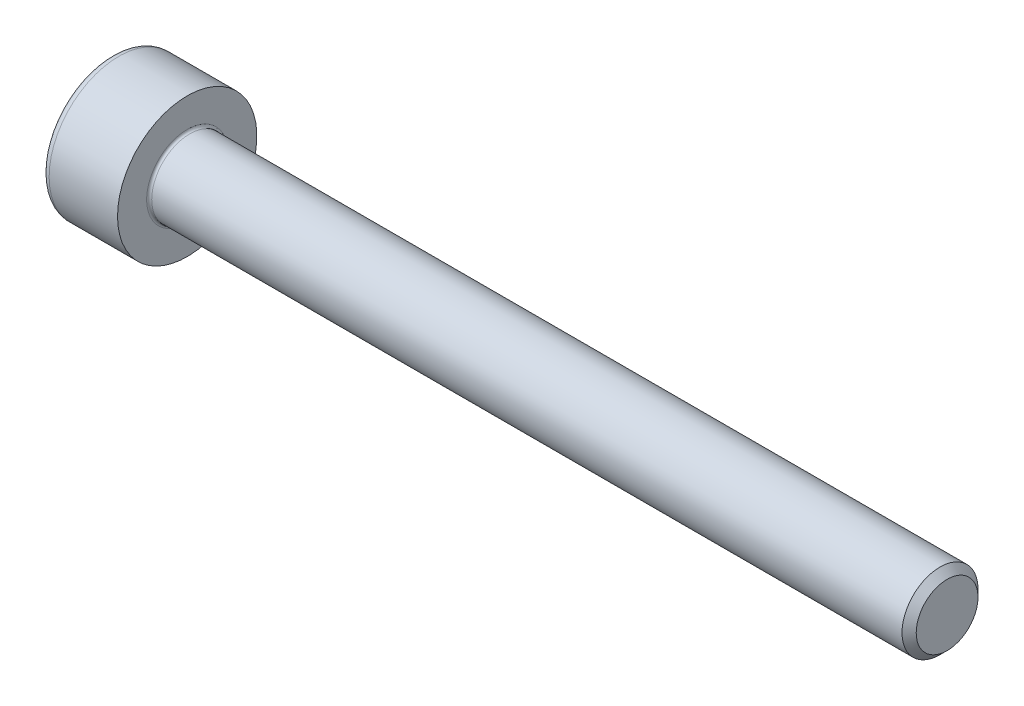
ISO-10303-21;
HEADER;
FILE_DESCRIPTION(('STEP AP214'),'2;1');
FILE_NAME('part.step','',(''),(''),'','','');
FILE_SCHEMA(('AUTOMOTIVE_DESIGN { 1 0 10303 214 1 1 1 1 }'));
ENDSEC;
DATA;
#1=APPLICATION_CONTEXT('core data for automotive mechanical design processes');
#2=APPLICATION_PROTOCOL_DEFINITION('international standard','automotive_design',2000,#1);
#3=PRODUCT_CONTEXT('',#1,'mechanical');
#4=PRODUCT('Part','Part','',(#3));
#5=PRODUCT_RELATED_PRODUCT_CATEGORY('part','',(#4));
#6=PRODUCT_DEFINITION_FORMATION('','',#4);
#7=PRODUCT_DEFINITION_CONTEXT('part definition',#1,'design');
#8=PRODUCT_DEFINITION('design','',#6,#7);
#9=PRODUCT_DEFINITION_SHAPE('','',#8);
#10=(LENGTH_UNIT() NAMED_UNIT(*) SI_UNIT(.MILLI.,.METRE.));
#11=(NAMED_UNIT(*) PLANE_ANGLE_UNIT() SI_UNIT($,.RADIAN.));
#12=(NAMED_UNIT(*) SI_UNIT($,.STERADIAN.) SOLID_ANGLE_UNIT());
#13=UNCERTAINTY_MEASURE_WITH_UNIT(LENGTH_MEASURE(1.E-05),#10,'distance_accuracy_value','');
#14=(GEOMETRIC_REPRESENTATION_CONTEXT(3) GLOBAL_UNCERTAINTY_ASSIGNED_CONTEXT((#13)) GLOBAL_UNIT_ASSIGNED_CONTEXT((#10,
#11,#12)) REPRESENTATION_CONTEXT('',''));
#15=CARTESIAN_POINT('',(0.,0.,0.));
#16=DIRECTION('',(0.,0.,1.));
#17=DIRECTION('',(1.,0.,0.));
#18=AXIS2_PLACEMENT_3D('',#15,#16,#17);
#19=CARTESIAN_POINT('',(0.,0.,0.));
#20=DIRECTION('',(-1.,0.,0.));
#21=DIRECTION('',(0.,0.,1.));
#22=AXIS2_PLACEMENT_3D('',#19,#20,#21);
#23=PLANE('',#22);
#24=DIRECTION('',(0.,-0.5,0.866025403784439));
#25=VECTOR('',#24,1.);
#26=CARTESIAN_POINT('',(0.,1.45492267835785,0.));
#27=LINE('',#26,#25);
#28=CARTESIAN_POINT('',(0.,1.45492267835785,0.));
#29=VERTEX_POINT('',#28);
#30=CARTESIAN_POINT('',(0.,0.727461339178924,1.26));
#31=VERTEX_POINT('',#30);
#32=EDGE_CURVE('E258',#29,#31,#27,.T.);
#33=ORIENTED_EDGE('',*,*,#32,.T.);
#34=DIRECTION('',(0.,1.,0.));
#35=VECTOR('',#34,1.);
#36=CARTESIAN_POINT('',(0.,-0.727461339178933,1.26));
#37=LINE('',#36,#35);
#38=CARTESIAN_POINT('',(0.,-0.727461339178933,1.26));
#39=VERTEX_POINT('',#38);
#40=EDGE_CURVE('E130',#39,#31,#37,.T.);
#41=ORIENTED_EDGE('',*,*,#40,.F.);
#42=DIRECTION('',(0.,-0.500000000000001,-0.866025403784438));
#43=VECTOR('',#42,1.);
#44=CARTESIAN_POINT('',(0.,-0.727461339178933,1.26));
#45=LINE('',#44,#43);
#46=CARTESIAN_POINT('',(0.,-1.45492267835786,0.));
#47=VERTEX_POINT('',#46);
#48=EDGE_CURVE('E261',#39,#47,#45,.T.);
#49=ORIENTED_EDGE('',*,*,#48,.T.);
#50=DIRECTION('',(0.,0.5,-0.866025403784439));
#51=VECTOR('',#50,1.);
#52=CARTESIAN_POINT('',(0.,-1.45492267835786,0.));
#53=LINE('',#52,#51);
#54=CARTESIAN_POINT('',(0.,-0.727461339178936,-1.26));
#55=VERTEX_POINT('',#54);
#56=EDGE_CURVE('E264',#47,#55,#53,.T.);
#57=ORIENTED_EDGE('',*,*,#56,.T.);
#58=DIRECTION('',(0.,-1.,0.));
#59=VECTOR('',#58,1.);
#60=CARTESIAN_POINT('',(0.,0.727461339178922,-1.26));
#61=LINE('',#60,#59);
#62=CARTESIAN_POINT('',(0.,0.727461339178922,-1.26));
#63=VERTEX_POINT('',#62);
#64=EDGE_CURVE('E267',#63,#55,#61,.T.);
#65=ORIENTED_EDGE('',*,*,#64,.F.);
#66=DIRECTION('',(0.,-0.500000000000001,-0.866025403784438));
#67=VECTOR('',#66,1.);
#68=CARTESIAN_POINT('',(0.,1.45492267835785,0.));
#69=LINE('',#68,#67);
#70=EDGE_CURVE('E125',#29,#63,#69,.T.);
#71=ORIENTED_EDGE('',*,*,#70,.F.);
#72=EDGE_LOOP('',(#33,#41,#49,#57,#65,#71));
#73=FACE_BOUND('',#72,.T.);
#74=CARTESIAN_POINT('',(0.,0.,0.));
#75=DIRECTION('',(-1.,0.,0.));
#76=DIRECTION('',(0.,0.,1.));
#77=AXIS2_PLACEMENT_3D('',#74,#75,#76);
#78=CIRCLE('',#77,2.45);
#79=CARTESIAN_POINT('',(0.,0.,2.45));
#80=VERTEX_POINT('',#79);
#81=EDGE_CURVE('E42',#80,#80,#78,.T.);
#82=ORIENTED_EDGE('',*,*,#81,.T.);
#83=EDGE_LOOP('',(#82));
#84=FACE_BOUND('',#83,.T.);
#85=ADVANCED_FACE('F34',(#73,#84),#23,.T.);
#86=CARTESIAN_POINT('',(-31.75,0.,0.));
#87=DIRECTION('',(-1.,0.,0.));
#88=DIRECTION('',(0.,0.,1.));
#89=AXIS2_PLACEMENT_3D('',#86,#87,#88);
#90=CYLINDRICAL_SURFACE('',#89,2.75);
#91=CARTESIAN_POINT('',(0.300000000000002,0.,0.));
#92=DIRECTION('',(-1.,0.,0.));
#93=DIRECTION('',(0.,0.,1.));
#94=AXIS2_PLACEMENT_3D('',#91,#92,#93);
#95=CIRCLE('',#94,2.75);
#96=CARTESIAN_POINT('',(0.300000000000002,0.,2.75));
#97=VERTEX_POINT('',#96);
#98=EDGE_CURVE('E11',#97,#97,#95,.F.);
#99=ORIENTED_EDGE('',*,*,#98,.T.);
#100=EDGE_LOOP('',(#99));
#101=FACE_BOUND('',#100,.T.);
#102=CARTESIAN_POINT('',(3.,0.,0.));
#103=DIRECTION('',(-1.,0.,0.));
#104=DIRECTION('',(0.,0.,1.));
#105=AXIS2_PLACEMENT_3D('',#102,#103,#104);
#106=CIRCLE('',#105,2.75);
#107=CARTESIAN_POINT('',(3.,0.,2.75));
#108=VERTEX_POINT('',#107);
#109=EDGE_CURVE('E148',#108,#108,#106,.T.);
#110=ORIENTED_EDGE('',*,*,#109,.T.);
#111=EDGE_LOOP('',(#110));
#112=FACE_BOUND('',#111,.T.);
#113=ADVANCED_FACE('F172',(#101,#112),#90,.T.);
#114=CARTESIAN_POINT('',(3.,2.75,0.));
#115=DIRECTION('',(1.,0.,0.));
#116=DIRECTION('',(0.,0.,-1.));
#117=AXIS2_PLACEMENT_3D('',#114,#115,#116);
#118=PLANE('',#117);
#119=CARTESIAN_POINT('',(3.,0.,0.));
#120=DIRECTION('',(1.,0.,0.));
#121=DIRECTION('',(0.,0.,-1.));
#122=AXIS2_PLACEMENT_3D('',#119,#120,#121);
#123=CIRCLE('',#122,1.6);
#124=CARTESIAN_POINT('',(3.,0.,-1.6));
#125=VERTEX_POINT('',#124);
#126=EDGE_CURVE('E151',#125,#125,#123,.F.);
#127=ORIENTED_EDGE('',*,*,#126,.T.);
#128=EDGE_LOOP('',(#127));
#129=FACE_BOUND('',#128,.T.);
#130=ORIENTED_EDGE('',*,*,#109,.F.);
#131=EDGE_LOOP('',(#130));
#132=FACE_BOUND('',#131,.T.);
#133=ADVANCED_FACE('F178',(#129,#132),#118,.T.);
#134=CARTESIAN_POINT('',(-31.75,0.,0.));
#135=DIRECTION('',(-1.,0.,0.));
#136=DIRECTION('',(0.,0.,1.));
#137=AXIS2_PLACEMENT_3D('',#134,#135,#136);
#138=CYLINDRICAL_SURFACE('',#137,1.5);
#139=CARTESIAN_POINT('',(3.1,0.,0.));
#140=DIRECTION('',(1.,0.,0.));
#141=DIRECTION('',(0.,0.,-1.));
#142=AXIS2_PLACEMENT_3D('',#139,#140,#141);
#143=CIRCLE('',#142,1.5);
#144=CARTESIAN_POINT('',(3.1,0.,-1.5));
#145=VERTEX_POINT('',#144);
#146=EDGE_CURVE('E154',#145,#145,#143,.T.);
#147=ORIENTED_EDGE('',*,*,#146,.T.);
#148=EDGE_LOOP('',(#147));
#149=FACE_BOUND('',#148,.T.);
#150=CARTESIAN_POINT('',(32.7195,0.,0.));
#151=DIRECTION('',(-1.,0.,0.));
#152=DIRECTION('',(0.,0.,1.));
#153=AXIS2_PLACEMENT_3D('',#150,#151,#152);
#154=CIRCLE('',#153,1.49999999999999);
#155=CARTESIAN_POINT('',(32.7195,0.,1.49999999999999));
#156=VERTEX_POINT('',#155);
#157=EDGE_CURVE('E145',#156,#156,#154,.T.);
#158=ORIENTED_EDGE('',*,*,#157,.T.);
#159=EDGE_LOOP('',(#158));
#160=FACE_BOUND('',#159,.T.);
#161=ADVANCED_FACE('F184',(#149,#160),#138,.T.);
#162=CARTESIAN_POINT('',(33.,0.,0.));
#163=DIRECTION('',(-1.,0.,0.));
#164=DIRECTION('',(0.,0.,1.));
#165=AXIS2_PLACEMENT_3D('',#162,#163,#164);
#166=CONICAL_SURFACE('',#165,1.2195,0.785398163397427);
#167=ORIENTED_EDGE('',*,*,#157,.F.);
#168=EDGE_LOOP('',(#167));
#169=FACE_BOUND('',#168,.T.);
#170=CARTESIAN_POINT('',(33.,0.,0.));
#171=DIRECTION('',(-1.,0.,0.));
#172=DIRECTION('',(0.,0.,1.));
#173=AXIS2_PLACEMENT_3D('',#170,#171,#172);
#174=CIRCLE('',#173,1.2195);
#175=CARTESIAN_POINT('',(33.,0.,1.2195));
#176=VERTEX_POINT('',#175);
#177=EDGE_CURVE('E141',#176,#176,#174,.T.);
#178=ORIENTED_EDGE('',*,*,#177,.T.);
#179=EDGE_LOOP('',(#178));
#180=FACE_BOUND('',#179,.T.);
#181=ADVANCED_FACE('F188',(#169,#180),#166,.T.);
#182=CARTESIAN_POINT('',(33.,1.2195,0.));
#183=DIRECTION('',(1.,0.,0.));
#184=DIRECTION('',(0.,0.,-1.));
#185=AXIS2_PLACEMENT_3D('',#182,#183,#184);
#186=PLANE('',#185);
#187=ORIENTED_EDGE('',*,*,#177,.F.);
#188=EDGE_LOOP('',(#187));
#189=FACE_BOUND('',#188,.T.);
#190=ADVANCED_FACE('F168',(#189),#186,.T.);
#191=CARTESIAN_POINT('',(3.1,0.,0.));
#192=DIRECTION('',(1.,0.,0.));
#193=DIRECTION('',(0.,0.,-1.));
#194=AXIS2_PLACEMENT_3D('',#191,#192,#193);
#195=TOROIDAL_SURFACE('',#194,1.6,0.1);
#196=ORIENTED_EDGE('',*,*,#146,.F.);
#197=EDGE_LOOP('',(#196));
#198=FACE_BOUND('',#197,.T.);
#199=ORIENTED_EDGE('',*,*,#126,.F.);
#200=EDGE_LOOP('',(#199));
#201=FACE_BOUND('',#200,.T.);
#202=ADVANCED_FACE('F161',(#198,#201),#195,.F.);
#203=CARTESIAN_POINT('',(0.300000000000002,0.,0.));
#204=DIRECTION('',(-1.,0.,0.));
#205=DIRECTION('',(0.,0.,1.));
#206=AXIS2_PLACEMENT_3D('',#203,#204,#205);
#207=TOROIDAL_SURFACE('',#206,2.45,0.3);
#208=ORIENTED_EDGE('',*,*,#98,.F.);
#209=EDGE_LOOP('',(#208));
#210=FACE_BOUND('',#209,.T.);
#211=ORIENTED_EDGE('',*,*,#81,.F.);
#212=EDGE_LOOP('',(#211));
#213=FACE_BOUND('',#212,.T.);
#214=ADVANCED_FACE('F36',(#210,#213),#207,.T.);
#215=CARTESIAN_POINT('',(1.3,1.45492267835785,0.));
#216=DIRECTION('',(0.,-0.866025403784439,-0.5));
#217=DIRECTION('',(0.,0.5,-0.866025403784439));
#218=AXIS2_PLACEMENT_3D('',#215,#216,#217);
#219=PLANE('',#218);
#220=ORIENTED_EDGE('',*,*,#32,.F.);
#221=DIRECTION('',(-1.,0.,0.));
#222=VECTOR('',#221,1.);
#223=CARTESIAN_POINT('',(1.3,1.45492267835785,0.));
#224=LINE('',#223,#222);
#225=CARTESIAN_POINT('',(1.3,1.45492267835785,0.));
#226=VERTEX_POINT('',#225);
#227=EDGE_CURVE('E248',#226,#29,#224,.T.);
#228=ORIENTED_EDGE('',*,*,#227,.F.);
#229=DIRECTION('',(0.,-0.5,0.866025403784439));
#230=VECTOR('',#229,1.);
#231=CARTESIAN_POINT('',(1.3,1.45492267835785,0.));
#232=LINE('',#231,#230);
#233=CARTESIAN_POINT('',(1.3,1.09119200876839,0.629999999999997));
#234=VERTEX_POINT('',#233);
#235=EDGE_CURVE('E117',#226,#234,#232,.T.);
#236=ORIENTED_EDGE('',*,*,#235,.T.);
#237=CARTESIAN_POINT('',(1.3,0.727461339178924,1.26));
#238=VERTEX_POINT('',#237);
#239=EDGE_CURVE('E108',#234,#238,#232,.T.);
#240=ORIENTED_EDGE('',*,*,#239,.T.);
#241=DIRECTION('',(-1.,0.,0.));
#242=VECTOR('',#241,1.);
#243=CARTESIAN_POINT('',(1.3,0.727461339178924,1.26));
#244=LINE('',#243,#242);
#245=EDGE_CURVE('E122',#238,#31,#244,.T.);
#246=ORIENTED_EDGE('',*,*,#245,.T.);
#247=EDGE_LOOP('',(#220,#228,#236,#240,#246));
#248=FACE_BOUND('',#247,.T.);
#249=ADVANCED_FACE('F121',(#248),#219,.T.);
#250=CARTESIAN_POINT('',(1.3,-0.727461339178933,1.26));
#251=DIRECTION('',(0.,0.,1.));
#252=DIRECTION('',(0.,-1.,0.));
#253=AXIS2_PLACEMENT_3D('',#250,#251,#252);
#254=PLANE('',#253);
#255=ORIENTED_EDGE('',*,*,#40,.T.);
#256=ORIENTED_EDGE('',*,*,#245,.F.);
#257=DIRECTION('',(0.,1.,0.));
#258=VECTOR('',#257,1.);
#259=CARTESIAN_POINT('',(1.3,-0.727461339178933,1.26));
#260=LINE('',#259,#258);
#261=CARTESIAN_POINT('',(1.3,0.,1.26));
#262=VERTEX_POINT('',#261);
#263=EDGE_CURVE('E105',#262,#238,#260,.T.);
#264=ORIENTED_EDGE('',*,*,#263,.F.);
#265=CARTESIAN_POINT('',(1.3,-0.727461339178933,1.26));
#266=VERTEX_POINT('',#265);
#267=EDGE_CURVE('E116',#266,#262,#260,.T.);
#268=ORIENTED_EDGE('',*,*,#267,.F.);
#269=DIRECTION('',(-1.,0.,0.));
#270=VECTOR('',#269,1.);
#271=CARTESIAN_POINT('',(1.3,-0.727461339178933,1.26));
#272=LINE('',#271,#270);
#273=EDGE_CURVE('E132',#266,#39,#272,.T.);
#274=ORIENTED_EDGE('',*,*,#273,.T.);
#275=EDGE_LOOP('',(#255,#256,#264,#268,#274));
#276=FACE_BOUND('',#275,.T.);
#277=ADVANCED_FACE('F127',(#276),#254,.F.);
#278=CARTESIAN_POINT('',(1.3,-0.727461339178933,1.26));
#279=DIRECTION('',(0.,0.866025403784438,-0.500000000000001));
#280=DIRECTION('',(0.,0.500000000000001,0.866025403784438));
#281=AXIS2_PLACEMENT_3D('',#278,#279,#280);
#282=PLANE('',#281);
#283=ORIENTED_EDGE('',*,*,#48,.F.);
#284=ORIENTED_EDGE('',*,*,#273,.F.);
#285=DIRECTION('',(0.,-0.500000000000001,-0.866025403784438));
#286=VECTOR('',#285,1.);
#287=CARTESIAN_POINT('',(1.3,-0.727461339178933,1.26));
#288=LINE('',#287,#286);
#289=CARTESIAN_POINT('',(1.3,-1.0911920087684,0.630000000000004));
#290=VERTEX_POINT('',#289);
#291=EDGE_CURVE('E287',#266,#290,#288,.T.);
#292=ORIENTED_EDGE('',*,*,#291,.T.);
#293=CARTESIAN_POINT('',(1.3,-1.45492267835786,0.));
#294=VERTEX_POINT('',#293);
#295=EDGE_CURVE('E276',#290,#294,#288,.T.);
#296=ORIENTED_EDGE('',*,*,#295,.T.);
#297=DIRECTION('',(-1.,0.,0.));
#298=VECTOR('',#297,1.);
#299=CARTESIAN_POINT('',(1.3,-1.45492267835786,0.));
#300=LINE('',#299,#298);
#301=EDGE_CURVE('E137',#294,#47,#300,.T.);
#302=ORIENTED_EDGE('',*,*,#301,.T.);
#303=EDGE_LOOP('',(#283,#284,#292,#296,#302));
#304=FACE_BOUND('',#303,.T.);
#305=ADVANCED_FACE('F202',(#304),#282,.T.);
#306=CARTESIAN_POINT('',(1.3,-1.45492267835786,0.));
#307=DIRECTION('',(0.,0.866025403784439,0.5));
#308=DIRECTION('',(0.,-0.5,0.866025403784439));
#309=AXIS2_PLACEMENT_3D('',#306,#307,#308);
#310=PLANE('',#309);
#311=ORIENTED_EDGE('',*,*,#56,.F.);
#312=ORIENTED_EDGE('',*,*,#301,.F.);
#313=DIRECTION('',(0.,0.5,-0.866025403784439));
#314=VECTOR('',#313,1.);
#315=CARTESIAN_POINT('',(1.3,-1.45492267835786,0.));
#316=LINE('',#315,#314);
#317=CARTESIAN_POINT('',(1.3,-1.0911920087684,-0.630000000000002));
#318=VERTEX_POINT('',#317);
#319=EDGE_CURVE('E254',#294,#318,#316,.T.);
#320=ORIENTED_EDGE('',*,*,#319,.T.);
#321=CARTESIAN_POINT('',(1.3,-0.727461339178936,-1.26));
#322=VERTEX_POINT('',#321);
#323=EDGE_CURVE('E286',#318,#322,#316,.T.);
#324=ORIENTED_EDGE('',*,*,#323,.T.);
#325=DIRECTION('',(-1.,0.,0.));
#326=VECTOR('',#325,1.);
#327=CARTESIAN_POINT('',(1.3,-0.727461339178936,-1.26));
#328=LINE('',#327,#326);
#329=EDGE_CURVE('E247',#322,#55,#328,.T.);
#330=ORIENTED_EDGE('',*,*,#329,.T.);
#331=EDGE_LOOP('',(#311,#312,#320,#324,#330));
#332=FACE_BOUND('',#331,.T.);
#333=ADVANCED_FACE('F205',(#332),#310,.T.);
#334=CARTESIAN_POINT('',(1.3,0.727461339178922,-1.26));
#335=DIRECTION('',(0.,0.,-1.));
#336=DIRECTION('',(0.,1.,0.));
#337=AXIS2_PLACEMENT_3D('',#334,#335,#336);
#338=PLANE('',#337);
#339=ORIENTED_EDGE('',*,*,#64,.T.);
#340=ORIENTED_EDGE('',*,*,#329,.F.);
#341=DIRECTION('',(0.,-1.,0.));
#342=VECTOR('',#341,1.);
#343=CARTESIAN_POINT('',(1.3,0.727461339178922,-1.26));
#344=LINE('',#343,#342);
#345=CARTESIAN_POINT('',(1.3,0.,-1.26));
#346=VERTEX_POINT('',#345);
#347=EDGE_CURVE('E251',#346,#322,#344,.T.);
#348=ORIENTED_EDGE('',*,*,#347,.F.);
#349=CARTESIAN_POINT('',(1.3,0.727461339178922,-1.26));
#350=VERTEX_POINT('',#349);
#351=EDGE_CURVE('E49',#350,#346,#344,.T.);
#352=ORIENTED_EDGE('',*,*,#351,.F.);
#353=DIRECTION('',(-1.,0.,0.));
#354=VECTOR('',#353,1.);
#355=CARTESIAN_POINT('',(1.3,0.727461339178922,-1.26));
#356=LINE('',#355,#354);
#357=EDGE_CURVE('E244',#350,#63,#356,.T.);
#358=ORIENTED_EDGE('',*,*,#357,.T.);
#359=EDGE_LOOP('',(#339,#340,#348,#352,#358));
#360=FACE_BOUND('',#359,.T.);
#361=ADVANCED_FACE('F209',(#360),#338,.F.);
#362=CARTESIAN_POINT('',(1.3,1.45492267835785,0.));
#363=DIRECTION('',(0.,0.866025403784438,-0.500000000000001));
#364=DIRECTION('',(0.,0.500000000000001,0.866025403784438));
#365=AXIS2_PLACEMENT_3D('',#362,#363,#364);
#366=PLANE('',#365);
#367=ORIENTED_EDGE('',*,*,#70,.T.);
#368=ORIENTED_EDGE('',*,*,#357,.F.);
#369=DIRECTION('',(0.,-0.500000000000001,-0.866025403784438));
#370=VECTOR('',#369,1.);
#371=CARTESIAN_POINT('',(1.3,1.45492267835785,0.));
#372=LINE('',#371,#370);
#373=CARTESIAN_POINT('',(1.3,1.09119200876839,-0.629999999999999));
#374=VERTEX_POINT('',#373);
#375=EDGE_CURVE('E234',#374,#350,#372,.T.);
#376=ORIENTED_EDGE('',*,*,#375,.F.);
#377=EDGE_CURVE('E240',#226,#374,#372,.T.);
#378=ORIENTED_EDGE('',*,*,#377,.F.);
#379=ORIENTED_EDGE('',*,*,#227,.T.);
#380=EDGE_LOOP('',(#367,#368,#376,#378,#379));
#381=FACE_BOUND('',#380,.T.);
#382=ADVANCED_FACE('F213',(#381),#366,.F.);
#383=CARTESIAN_POINT('',(1.3,1.45492267835785,0.));
#384=DIRECTION('',(1.,0.,0.));
#385=DIRECTION('',(0.,0.,-1.));
#386=AXIS2_PLACEMENT_3D('',#383,#384,#385);
#387=PLANE('',#386);
#388=ORIENTED_EDGE('',*,*,#347,.T.);
#389=ORIENTED_EDGE('',*,*,#323,.F.);
#390=CARTESIAN_POINT('',(1.3,0.,0.));
#391=DIRECTION('',(-1.,0.,0.));
#392=DIRECTION('',(0.,0.,1.));
#393=AXIS2_PLACEMENT_3D('',#390,#391,#392);
#394=CIRCLE('',#393,1.26);
#395=EDGE_CURVE('E282',#346,#318,#394,.T.);
#396=ORIENTED_EDGE('',*,*,#395,.F.);
#397=EDGE_LOOP('',(#388,#389,#396));
#398=FACE_BOUND('',#397,.T.);
#399=ADVANCED_FACE('F217',(#398),#387,.F.);
#400=ORIENTED_EDGE('',*,*,#319,.F.);
#401=ORIENTED_EDGE('',*,*,#295,.F.);
#402=EDGE_CURVE('E135',#318,#290,#394,.T.);
#403=ORIENTED_EDGE('',*,*,#402,.F.);
#404=EDGE_LOOP('',(#400,#401,#403));
#405=FACE_BOUND('',#404,.T.);
#406=ADVANCED_FACE('F220',(#405),#387,.F.);
#407=ORIENTED_EDGE('',*,*,#291,.F.);
#408=ORIENTED_EDGE('',*,*,#267,.T.);
#409=EDGE_CURVE('E131',#290,#262,#394,.T.);
#410=ORIENTED_EDGE('',*,*,#409,.F.);
#411=EDGE_LOOP('',(#407,#408,#410));
#412=FACE_BOUND('',#411,.T.);
#413=ADVANCED_FACE('F225',(#412),#387,.F.);
#414=ORIENTED_EDGE('',*,*,#263,.T.);
#415=ORIENTED_EDGE('',*,*,#239,.F.);
#416=EDGE_CURVE('E111',#262,#234,#394,.T.);
#417=ORIENTED_EDGE('',*,*,#416,.F.);
#418=EDGE_LOOP('',(#414,#415,#417));
#419=FACE_BOUND('',#418,.T.);
#420=ADVANCED_FACE('F107',(#419),#387,.F.);
#421=ORIENTED_EDGE('',*,*,#235,.F.);
#422=ORIENTED_EDGE('',*,*,#377,.T.);
#423=EDGE_CURVE('E142',#234,#374,#394,.T.);
#424=ORIENTED_EDGE('',*,*,#423,.F.);
#425=EDGE_LOOP('',(#421,#422,#424));
#426=FACE_BOUND('',#425,.T.);
#427=ADVANCED_FACE('F228',(#426),#387,.F.);
#428=ORIENTED_EDGE('',*,*,#375,.T.);
#429=ORIENTED_EDGE('',*,*,#351,.T.);
#430=EDGE_CURVE('E237',#374,#346,#394,.T.);
#431=ORIENTED_EDGE('',*,*,#430,.F.);
#432=EDGE_LOOP('',(#428,#429,#431));
#433=FACE_BOUND('',#432,.T.);
#434=ADVANCED_FACE('F198',(#433),#387,.F.);
#435=CARTESIAN_POINT('',(1.3,0.,0.));
#436=DIRECTION('',(-1.,0.,0.));
#437=DIRECTION('',(0.,0.,1.));
#438=AXIS2_PLACEMENT_3D('',#435,#436,#437);
#439=CONICAL_SURFACE('',#438,1.26,1.04719755119659);
#440=CARTESIAN_POINT('',(2.02746133917894,0.,0.));
#441=VERTEX_POINT('',#440);
#442=VERTEX_LOOP('',#441);
#443=FACE_BOUND('',#442,.T.);
#444=ORIENTED_EDGE('',*,*,#416,.T.);
#445=ORIENTED_EDGE('',*,*,#423,.T.);
#446=ORIENTED_EDGE('',*,*,#430,.T.);
#447=ORIENTED_EDGE('',*,*,#395,.T.);
#448=ORIENTED_EDGE('',*,*,#402,.T.);
#449=ORIENTED_EDGE('',*,*,#409,.T.);
#450=EDGE_LOOP('',(#444,#445,#446,#447,#448,#449));
#451=FACE_BOUND('',#450,.T.);
#452=ADVANCED_FACE('F196',(#443,#451),#439,.F.);
#453=CLOSED_SHELL('',(#85,#113,#133,#161,#181,#190,#202,#214,#249,#277,#305,#333,#361,#382,#399,
#406,#413,#420,#427,#434,#452));
#454=MANIFOLD_SOLID_BREP('B2',#453);
#455=ADVANCED_BREP_SHAPE_REPRESENTATION('',(#18,#454),#14);
#456=SHAPE_DEFINITION_REPRESENTATION(#9,#455);
ENDSEC;
END-ISO-10303-21;
